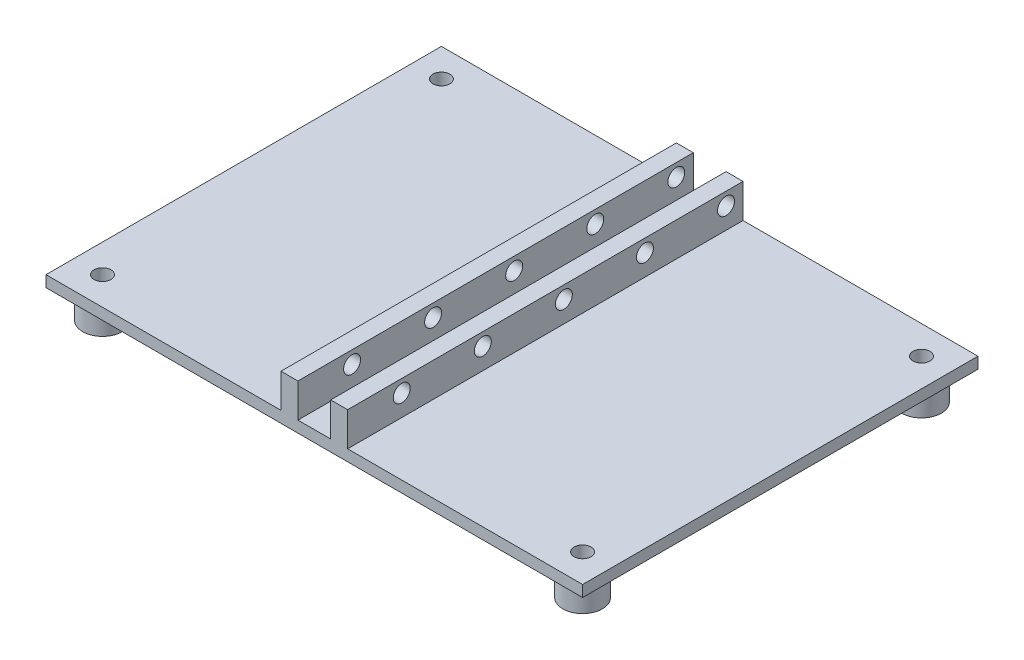
ISO-10303-21;
HEADER;
FILE_DESCRIPTION(('STEP AP214'),'2;1');
FILE_NAME('part.step','',(''),(''),'','','');
FILE_SCHEMA(('AUTOMOTIVE_DESIGN { 1 0 10303 214 1 1 1 1 }'));
ENDSEC;
DATA;
#1=APPLICATION_CONTEXT('core data for automotive mechanical design processes');
#2=APPLICATION_PROTOCOL_DEFINITION('international standard','automotive_design',2000,#1);
#3=PRODUCT_CONTEXT('',#1,'mechanical');
#4=PRODUCT('Part','Part','',(#3));
#5=PRODUCT_RELATED_PRODUCT_CATEGORY('part','',(#4));
#6=PRODUCT_DEFINITION_FORMATION('','',#4);
#7=PRODUCT_DEFINITION_CONTEXT('part definition',#1,'design');
#8=PRODUCT_DEFINITION('design','',#6,#7);
#9=PRODUCT_DEFINITION_SHAPE('','',#8);
#10=(LENGTH_UNIT() NAMED_UNIT(*) SI_UNIT(.MILLI.,.METRE.));
#11=(NAMED_UNIT(*) PLANE_ANGLE_UNIT() SI_UNIT($,.RADIAN.));
#12=(NAMED_UNIT(*) SI_UNIT($,.STERADIAN.) SOLID_ANGLE_UNIT());
#13=UNCERTAINTY_MEASURE_WITH_UNIT(LENGTH_MEASURE(1.E-05),#10,'distance_accuracy_value','');
#14=(GEOMETRIC_REPRESENTATION_CONTEXT(3) GLOBAL_UNCERTAINTY_ASSIGNED_CONTEXT((#13)) GLOBAL_UNIT_ASSIGNED_CONTEXT((#10,
#11,#12)) REPRESENTATION_CONTEXT('',''));
#15=CARTESIAN_POINT('',(0.,0.,0.));
#16=DIRECTION('',(0.,0.,1.));
#17=DIRECTION('',(1.,0.,0.));
#18=AXIS2_PLACEMENT_3D('',#15,#16,#17);
#19=CARTESIAN_POINT('',(0.,0.,0.));
#20=DIRECTION('',(0.,1.,0.));
#21=DIRECTION('',(0.,0.,1.));
#22=AXIS2_PLACEMENT_3D('',#19,#20,#21);
#23=PLANE('',#22);
#24=CARTESIAN_POINT('',(42.5,0.,30.));
#25=DIRECTION('',(0.,1.,0.));
#26=DIRECTION('',(0.,0.,1.));
#27=AXIS2_PLACEMENT_3D('',#24,#25,#26);
#28=CIRCLE('',#27,3.5);
#29=CARTESIAN_POINT('',(42.5,0.,33.5));
#30=VERTEX_POINT('',#29);
#31=EDGE_CURVE('E47',#30,#30,#28,.F.);
#32=ORIENTED_EDGE('',*,*,#31,.F.);
#33=EDGE_LOOP('',(#32));
#34=FACE_BOUND('',#33,.T.);
#35=CARTESIAN_POINT('',(-42.5,0.,-30.));
#36=DIRECTION('',(0.,1.,0.));
#37=DIRECTION('',(0.,0.,1.));
#38=AXIS2_PLACEMENT_3D('',#35,#36,#37);
#39=CIRCLE('',#38,3.5);
#40=CARTESIAN_POINT('',(-42.5,0.,-26.5));
#41=VERTEX_POINT('',#40);
#42=EDGE_CURVE('E229',#41,#41,#39,.F.);
#43=ORIENTED_EDGE('',*,*,#42,.F.);
#44=EDGE_LOOP('',(#43));
#45=FACE_BOUND('',#44,.T.);
#46=DIRECTION('',(0.,0.,1.));
#47=VECTOR('',#46,1.);
#48=CARTESIAN_POINT('',(-47.5,0.,-35.));
#49=LINE('',#48,#47);
#50=CARTESIAN_POINT('',(-47.5,0.,-35.));
#51=VERTEX_POINT('',#50);
#52=CARTESIAN_POINT('',(-47.5,0.,35.));
#53=VERTEX_POINT('',#52);
#54=EDGE_CURVE('E197',#51,#53,#49,.T.);
#55=ORIENTED_EDGE('',*,*,#54,.F.);
#56=DIRECTION('',(-1.,0.,0.));
#57=VECTOR('',#56,1.);
#58=CARTESIAN_POINT('',(-47.5,0.,-35.));
#59=LINE('',#58,#57);
#60=CARTESIAN_POINT('',(47.5,0.,-35.));
#61=VERTEX_POINT('',#60);
#62=EDGE_CURVE('E201',#61,#51,#59,.T.);
#63=ORIENTED_EDGE('',*,*,#62,.F.);
#64=DIRECTION('',(0.,0.,-1.));
#65=VECTOR('',#64,1.);
#66=CARTESIAN_POINT('',(47.5,0.,-35.));
#67=LINE('',#66,#65);
#68=CARTESIAN_POINT('',(47.5,0.,35.));
#69=VERTEX_POINT('',#68);
#70=EDGE_CURVE('E215',#69,#61,#67,.T.);
#71=ORIENTED_EDGE('',*,*,#70,.F.);
#72=DIRECTION('',(1.,0.,0.));
#73=VECTOR('',#72,1.);
#74=CARTESIAN_POINT('',(-47.5,0.,35.));
#75=LINE('',#74,#73);
#76=EDGE_CURVE('E213',#53,#69,#75,.T.);
#77=ORIENTED_EDGE('',*,*,#76,.F.);
#78=EDGE_LOOP('',(#55,#63,#71,#77));
#79=FACE_BOUND('',#78,.T.);
#80=CARTESIAN_POINT('',(-42.5,0.,30.));
#81=DIRECTION('',(0.,1.,0.));
#82=DIRECTION('',(0.,0.,1.));
#83=AXIS2_PLACEMENT_3D('',#80,#81,#82);
#84=CIRCLE('',#83,3.5);
#85=CARTESIAN_POINT('',(-42.5,0.,33.5));
#86=VERTEX_POINT('',#85);
#87=EDGE_CURVE('E257',#86,#86,#84,.F.);
#88=ORIENTED_EDGE('',*,*,#87,.F.);
#89=EDGE_LOOP('',(#88));
#90=FACE_BOUND('',#89,.T.);
#91=CARTESIAN_POINT('',(42.5,0.,-30.));
#92=DIRECTION('',(0.,1.,0.));
#93=DIRECTION('',(0.,0.,1.));
#94=AXIS2_PLACEMENT_3D('',#91,#92,#93);
#95=CIRCLE('',#94,3.5);
#96=CARTESIAN_POINT('',(42.5,0.,-26.5));
#97=VERTEX_POINT('',#96);
#98=EDGE_CURVE('E11',#97,#97,#95,.F.);
#99=ORIENTED_EDGE('',*,*,#98,.F.);
#100=EDGE_LOOP('',(#99));
#101=FACE_BOUND('',#100,.T.);
#102=ADVANCED_FACE('F39',(#34,#45,#79,#90,#101),#23,.F.);
#103=CARTESIAN_POINT('',(0.,2.,0.));
#104=DIRECTION('',(0.,1.,0.));
#105=DIRECTION('',(0.,0.,1.));
#106=AXIS2_PLACEMENT_3D('',#103,#104,#105);
#107=PLANE('',#106);
#108=CARTESIAN_POINT('',(42.5,2.,-30.));
#109=DIRECTION('',(0.,1.,0.));
#110=DIRECTION('',(0.,0.,1.));
#111=AXIS2_PLACEMENT_3D('',#108,#109,#110);
#112=CIRCLE('',#111,1.5);
#113=CARTESIAN_POINT('',(42.5,2.,-28.5));
#114=VERTEX_POINT('',#113);
#115=EDGE_CURVE('E188',#114,#114,#112,.T.);
#116=ORIENTED_EDGE('',*,*,#115,.F.);
#117=EDGE_LOOP('',(#116));
#118=FACE_BOUND('',#117,.T.);
#119=CARTESIAN_POINT('',(42.5,2.,30.));
#120=DIRECTION('',(0.,1.,0.));
#121=DIRECTION('',(0.,0.,1.));
#122=AXIS2_PLACEMENT_3D('',#119,#120,#121);
#123=CIRCLE('',#122,1.5);
#124=CARTESIAN_POINT('',(42.5,2.,31.5));
#125=VERTEX_POINT('',#124);
#126=EDGE_CURVE('E185',#125,#125,#123,.T.);
#127=ORIENTED_EDGE('',*,*,#126,.F.);
#128=EDGE_LOOP('',(#127));
#129=FACE_BOUND('',#128,.T.);
#130=DIRECTION('',(-1.,0.,0.));
#131=VECTOR('',#130,1.);
#132=CARTESIAN_POINT('',(-47.5,2.,-35.));
#133=LINE('',#132,#131);
#134=CARTESIAN_POINT('',(47.5,2.,-35.));
#135=VERTEX_POINT('',#134);
#136=CARTESIAN_POINT('',(5.9,2.,-35.));
#137=VERTEX_POINT('',#136);
#138=EDGE_CURVE('E207',#135,#137,#133,.T.);
#139=ORIENTED_EDGE('',*,*,#138,.T.);
#140=DIRECTION('',(0.,0.,-1.));
#141=VECTOR('',#140,1.);
#142=CARTESIAN_POINT('',(5.9,2.,35.));
#143=LINE('',#142,#141);
#144=CARTESIAN_POINT('',(5.9,2.,35.));
#145=VERTEX_POINT('',#144);
#146=EDGE_CURVE('E54',#145,#137,#143,.T.);
#147=ORIENTED_EDGE('',*,*,#146,.F.);
#148=DIRECTION('',(1.,0.,0.));
#149=VECTOR('',#148,1.);
#150=CARTESIAN_POINT('',(-47.5,2.,35.));
#151=LINE('',#150,#149);
#152=CARTESIAN_POINT('',(47.5,2.,35.));
#153=VERTEX_POINT('',#152);
#154=EDGE_CURVE('E152',#145,#153,#151,.T.);
#155=ORIENTED_EDGE('',*,*,#154,.T.);
#156=DIRECTION('',(0.,0.,-1.));
#157=VECTOR('',#156,1.);
#158=CARTESIAN_POINT('',(47.5,2.,-35.));
#159=LINE('',#158,#157);
#160=EDGE_CURVE('E204',#153,#135,#159,.T.);
#161=ORIENTED_EDGE('',*,*,#160,.T.);
#162=EDGE_LOOP('',(#139,#147,#155,#161));
#163=FACE_BOUND('',#162,.T.);
#164=ADVANCED_FACE('F266',(#118,#129,#163),#107,.T.);
#165=CARTESIAN_POINT('',(-2.9,2.,35.));
#166=VERTEX_POINT('',#165);
#167=CARTESIAN_POINT('',(2.9,2.,35.));
#168=VERTEX_POINT('',#167);
#169=EDGE_CURVE('E62',#166,#168,#151,.T.);
#170=ORIENTED_EDGE('',*,*,#169,.T.);
#171=DIRECTION('',(0.,0.,1.));
#172=VECTOR('',#171,1.);
#173=CARTESIAN_POINT('',(2.9,2.,35.));
#174=LINE('',#173,#172);
#175=CARTESIAN_POINT('',(2.9,2.,-35.));
#176=VERTEX_POINT('',#175);
#177=EDGE_CURVE('E148',#176,#168,#174,.T.);
#178=ORIENTED_EDGE('',*,*,#177,.F.);
#179=CARTESIAN_POINT('',(-2.9,2.,-35.));
#180=VERTEX_POINT('',#179);
#181=EDGE_CURVE('E210',#176,#180,#133,.T.);
#182=ORIENTED_EDGE('',*,*,#181,.T.);
#183=DIRECTION('',(0.,0.,-1.));
#184=VECTOR('',#183,1.);
#185=CARTESIAN_POINT('',(-2.9,2.,35.));
#186=LINE('',#185,#184);
#187=EDGE_CURVE('E153',#166,#180,#186,.T.);
#188=ORIENTED_EDGE('',*,*,#187,.F.);
#189=EDGE_LOOP('',(#170,#178,#182,#188));
#190=FACE_BOUND('',#189,.T.);
#191=ADVANCED_FACE('F376',(#190),#107,.T.);
#192=DIRECTION('',(0.,0.,1.));
#193=VECTOR('',#192,1.);
#194=CARTESIAN_POINT('',(-5.9,2.,35.));
#195=LINE('',#194,#193);
#196=CARTESIAN_POINT('',(-5.9,2.,-35.));
#197=VERTEX_POINT('',#196);
#198=CARTESIAN_POINT('',(-5.9,2.,35.));
#199=VERTEX_POINT('',#198);
#200=EDGE_CURVE('E156',#197,#199,#195,.T.);
#201=ORIENTED_EDGE('',*,*,#200,.F.);
#202=CARTESIAN_POINT('',(-47.5,2.,-35.));
#203=VERTEX_POINT('',#202);
#204=EDGE_CURVE('E206',#197,#203,#133,.T.);
#205=ORIENTED_EDGE('',*,*,#204,.T.);
#206=DIRECTION('',(0.,0.,1.));
#207=VECTOR('',#206,1.);
#208=CARTESIAN_POINT('',(-47.5,2.,-35.));
#209=LINE('',#208,#207);
#210=CARTESIAN_POINT('',(-47.5,2.,35.));
#211=VERTEX_POINT('',#210);
#212=EDGE_CURVE('E198',#203,#211,#209,.T.);
#213=ORIENTED_EDGE('',*,*,#212,.T.);
#214=EDGE_CURVE('E202',#211,#199,#151,.T.);
#215=ORIENTED_EDGE('',*,*,#214,.T.);
#216=EDGE_LOOP('',(#201,#205,#213,#215));
#217=FACE_BOUND('',#216,.T.);
#218=CARTESIAN_POINT('',(-42.5,2.,30.));
#219=DIRECTION('',(0.,1.,0.));
#220=DIRECTION('',(0.,0.,1.));
#221=AXIS2_PLACEMENT_3D('',#218,#219,#220);
#222=CIRCLE('',#221,1.5);
#223=CARTESIAN_POINT('',(-42.5,2.,31.5));
#224=VERTEX_POINT('',#223);
#225=EDGE_CURVE('E191',#224,#224,#222,.T.);
#226=ORIENTED_EDGE('',*,*,#225,.F.);
#227=EDGE_LOOP('',(#226));
#228=FACE_BOUND('',#227,.T.);
#229=CARTESIAN_POINT('',(-42.5,2.,-30.));
#230=DIRECTION('',(0.,1.,0.));
#231=DIRECTION('',(0.,0.,1.));
#232=AXIS2_PLACEMENT_3D('',#229,#230,#231);
#233=CIRCLE('',#232,1.5);
#234=CARTESIAN_POINT('',(-42.5,2.,-28.5));
#235=VERTEX_POINT('',#234);
#236=EDGE_CURVE('E194',#235,#235,#233,.T.);
#237=ORIENTED_EDGE('',*,*,#236,.F.);
#238=EDGE_LOOP('',(#237));
#239=FACE_BOUND('',#238,.T.);
#240=ADVANCED_FACE('F378',(#217,#228,#239),#107,.T.);
#241=CARTESIAN_POINT('',(-47.5,2.,-35.));
#242=DIRECTION('',(1.,0.,0.));
#243=DIRECTION('',(0.,0.,-1.));
#244=AXIS2_PLACEMENT_3D('',#241,#242,#243);
#245=PLANE('',#244);
#246=ORIENTED_EDGE('',*,*,#54,.T.);
#247=DIRECTION('',(0.,-1.,0.));
#248=VECTOR('',#247,1.);
#249=CARTESIAN_POINT('',(-47.5,2.,35.));
#250=LINE('',#249,#248);
#251=EDGE_CURVE('E226',#211,#53,#250,.T.);
#252=ORIENTED_EDGE('',*,*,#251,.F.);
#253=ORIENTED_EDGE('',*,*,#212,.F.);
#254=DIRECTION('',(0.,-1.,0.));
#255=VECTOR('',#254,1.);
#256=CARTESIAN_POINT('',(-47.5,2.,-35.));
#257=LINE('',#256,#255);
#258=EDGE_CURVE('E209',#203,#51,#257,.T.);
#259=ORIENTED_EDGE('',*,*,#258,.T.);
#260=EDGE_LOOP('',(#246,#252,#253,#259));
#261=FACE_BOUND('',#260,.T.);
#262=ADVANCED_FACE('F41',(#261),#245,.F.);
#263=CARTESIAN_POINT('',(-47.5,2.,35.));
#264=DIRECTION('',(0.,0.,-1.));
#265=DIRECTION('',(-1.,0.,0.));
#266=AXIS2_PLACEMENT_3D('',#263,#264,#265);
#267=PLANE('',#266);
#268=ORIENTED_EDGE('',*,*,#76,.T.);
#269=DIRECTION('',(0.,-1.,0.));
#270=VECTOR('',#269,1.);
#271=CARTESIAN_POINT('',(47.5,2.,35.));
#272=LINE('',#271,#270);
#273=EDGE_CURVE('E223',#153,#69,#272,.T.);
#274=ORIENTED_EDGE('',*,*,#273,.F.);
#275=ORIENTED_EDGE('',*,*,#154,.F.);
#276=DIRECTION('',(0.,-1.,0.));
#277=VECTOR('',#276,1.);
#278=CARTESIAN_POINT('',(5.9,8.,35.));
#279=LINE('',#278,#277);
#280=CARTESIAN_POINT('',(5.9,8.,35.));
#281=VERTEX_POINT('',#280);
#282=EDGE_CURVE('E133',#281,#145,#279,.T.);
#283=ORIENTED_EDGE('',*,*,#282,.F.);
#284=DIRECTION('',(1.,0.,0.));
#285=VECTOR('',#284,1.);
#286=CARTESIAN_POINT('',(2.9,8.,35.));
#287=LINE('',#286,#285);
#288=CARTESIAN_POINT('',(2.9,8.,35.));
#289=VERTEX_POINT('',#288);
#290=EDGE_CURVE('E139',#289,#281,#287,.T.);
#291=ORIENTED_EDGE('',*,*,#290,.F.);
#292=DIRECTION('',(0.,-1.,0.));
#293=VECTOR('',#292,1.);
#294=CARTESIAN_POINT('',(2.9,8.,35.));
#295=LINE('',#294,#293);
#296=EDGE_CURVE('E414',#289,#168,#295,.T.);
#297=ORIENTED_EDGE('',*,*,#296,.T.);
#298=ORIENTED_EDGE('',*,*,#169,.F.);
#299=DIRECTION('',(0.,-1.,0.));
#300=VECTOR('',#299,1.);
#301=CARTESIAN_POINT('',(-2.9,8.,35.));
#302=LINE('',#301,#300);
#303=CARTESIAN_POINT('',(-2.9,8.,35.));
#304=VERTEX_POINT('',#303);
#305=EDGE_CURVE('E182',#304,#166,#302,.T.);
#306=ORIENTED_EDGE('',*,*,#305,.F.);
#307=DIRECTION('',(1.,0.,0.));
#308=VECTOR('',#307,1.);
#309=CARTESIAN_POINT('',(-5.9,8.,35.));
#310=LINE('',#309,#308);
#311=CARTESIAN_POINT('',(-5.9,8.,35.));
#312=VERTEX_POINT('',#311);
#313=EDGE_CURVE('E162',#312,#304,#310,.T.);
#314=ORIENTED_EDGE('',*,*,#313,.F.);
#315=DIRECTION('',(0.,-1.,0.));
#316=VECTOR('',#315,1.);
#317=CARTESIAN_POINT('',(-5.9,8.,35.));
#318=LINE('',#317,#316);
#319=EDGE_CURVE('E170',#312,#199,#318,.T.);
#320=ORIENTED_EDGE('',*,*,#319,.T.);
#321=ORIENTED_EDGE('',*,*,#214,.F.);
#322=ORIENTED_EDGE('',*,*,#251,.T.);
#323=EDGE_LOOP('',(#268,#274,#275,#283,#291,#297,#298,#306,#314,#320,#321,#322));
#324=FACE_BOUND('',#323,.T.);
#325=ADVANCED_FACE('F150',(#324),#267,.F.);
#326=CARTESIAN_POINT('',(47.5,2.,-35.));
#327=DIRECTION('',(-1.,0.,0.));
#328=DIRECTION('',(0.,0.,1.));
#329=AXIS2_PLACEMENT_3D('',#326,#327,#328);
#330=PLANE('',#329);
#331=ORIENTED_EDGE('',*,*,#70,.T.);
#332=DIRECTION('',(0.,-1.,0.));
#333=VECTOR('',#332,1.);
#334=CARTESIAN_POINT('',(47.5,2.,-35.));
#335=LINE('',#334,#333);
#336=EDGE_CURVE('E220',#135,#61,#335,.T.);
#337=ORIENTED_EDGE('',*,*,#336,.F.);
#338=ORIENTED_EDGE('',*,*,#160,.F.);
#339=ORIENTED_EDGE('',*,*,#273,.T.);
#340=EDGE_LOOP('',(#331,#337,#338,#339));
#341=FACE_BOUND('',#340,.T.);
#342=ADVANCED_FACE('F382',(#341),#330,.F.);
#343=CARTESIAN_POINT('',(-47.5,2.,-35.));
#344=DIRECTION('',(0.,0.,1.));
#345=DIRECTION('',(1.,0.,0.));
#346=AXIS2_PLACEMENT_3D('',#343,#344,#345);
#347=PLANE('',#346);
#348=ORIENTED_EDGE('',*,*,#62,.T.);
#349=ORIENTED_EDGE('',*,*,#258,.F.);
#350=ORIENTED_EDGE('',*,*,#204,.F.);
#351=DIRECTION('',(0.,-1.,0.));
#352=VECTOR('',#351,1.);
#353=CARTESIAN_POINT('',(-5.9,8.,-35.));
#354=LINE('',#353,#352);
#355=CARTESIAN_POINT('',(-5.9,8.,-35.));
#356=VERTEX_POINT('',#355);
#357=EDGE_CURVE('E176',#356,#197,#354,.T.);
#358=ORIENTED_EDGE('',*,*,#357,.F.);
#359=DIRECTION('',(-1.,0.,0.));
#360=VECTOR('',#359,1.);
#361=CARTESIAN_POINT('',(-2.9,8.,-35.));
#362=LINE('',#361,#360);
#363=CARTESIAN_POINT('',(-2.9,8.,-35.));
#364=VERTEX_POINT('',#363);
#365=EDGE_CURVE('E167',#364,#356,#362,.T.);
#366=ORIENTED_EDGE('',*,*,#365,.F.);
#367=DIRECTION('',(0.,-1.,0.));
#368=VECTOR('',#367,1.);
#369=CARTESIAN_POINT('',(-2.9,8.,-35.));
#370=LINE('',#369,#368);
#371=EDGE_CURVE('E179',#364,#180,#370,.T.);
#372=ORIENTED_EDGE('',*,*,#371,.T.);
#373=ORIENTED_EDGE('',*,*,#181,.F.);
#374=DIRECTION('',(0.,-1.,0.));
#375=VECTOR('',#374,1.);
#376=CARTESIAN_POINT('',(2.9,8.,-35.));
#377=LINE('',#376,#375);
#378=CARTESIAN_POINT('',(2.9,8.,-35.));
#379=VERTEX_POINT('',#378);
#380=EDGE_CURVE('E158',#379,#176,#377,.T.);
#381=ORIENTED_EDGE('',*,*,#380,.F.);
#382=DIRECTION('',(-1.,0.,0.));
#383=VECTOR('',#382,1.);
#384=CARTESIAN_POINT('',(5.9,8.,-35.));
#385=LINE('',#384,#383);
#386=CARTESIAN_POINT('',(5.9,8.,-35.));
#387=VERTEX_POINT('',#386);
#388=EDGE_CURVE('E138',#387,#379,#385,.T.);
#389=ORIENTED_EDGE('',*,*,#388,.F.);
#390=DIRECTION('',(0.,-1.,0.));
#391=VECTOR('',#390,1.);
#392=CARTESIAN_POINT('',(5.9,8.,-35.));
#393=LINE('',#392,#391);
#394=EDGE_CURVE('E135',#387,#137,#393,.T.);
#395=ORIENTED_EDGE('',*,*,#394,.T.);
#396=ORIENTED_EDGE('',*,*,#138,.F.);
#397=ORIENTED_EDGE('',*,*,#336,.T.);
#398=EDGE_LOOP('',(#348,#349,#350,#358,#366,#372,#373,#381,#389,#395,#396,#397));
#399=FACE_BOUND('',#398,.T.);
#400=ADVANCED_FACE('F373',(#399),#347,.F.);
#401=CARTESIAN_POINT('',(-42.5,2.,-30.));
#402=DIRECTION('',(0.,-1.,0.));
#403=DIRECTION('',(0.,0.,-1.));
#404=AXIS2_PLACEMENT_3D('',#401,#402,#403);
#405=CYLINDRICAL_SURFACE('',#404,1.5);
#406=ORIENTED_EDGE('',*,*,#236,.T.);
#407=EDGE_LOOP('',(#406));
#408=FACE_BOUND('',#407,.T.);
#409=CARTESIAN_POINT('',(-42.5,-5.,-30.));
#410=DIRECTION('',(0.,-1.,0.));
#411=DIRECTION('',(0.,0.,-1.));
#412=AXIS2_PLACEMENT_3D('',#409,#410,#411);
#413=CIRCLE('',#412,1.5);
#414=CARTESIAN_POINT('',(-42.5,-5.,-31.5));
#415=VERTEX_POINT('',#414);
#416=EDGE_CURVE('E460',#415,#415,#413,.T.);
#417=ORIENTED_EDGE('',*,*,#416,.T.);
#418=EDGE_LOOP('',(#417));
#419=FACE_BOUND('',#418,.T.);
#420=ADVANCED_FACE('F369',(#408,#419),#405,.F.);
#421=CARTESIAN_POINT('',(-42.5,2.,30.));
#422=DIRECTION('',(0.,-1.,0.));
#423=DIRECTION('',(0.,0.,-1.));
#424=AXIS2_PLACEMENT_3D('',#421,#422,#423);
#425=CYLINDRICAL_SURFACE('',#424,1.5);
#426=ORIENTED_EDGE('',*,*,#225,.T.);
#427=EDGE_LOOP('',(#426));
#428=FACE_BOUND('',#427,.T.);
#429=CARTESIAN_POINT('',(-42.5,-5.,30.));
#430=DIRECTION('',(0.,-1.,0.));
#431=DIRECTION('',(0.,0.,-1.));
#432=AXIS2_PLACEMENT_3D('',#429,#430,#431);
#433=CIRCLE('',#432,1.5);
#434=CARTESIAN_POINT('',(-42.5,-5.,28.5));
#435=VERTEX_POINT('',#434);
#436=EDGE_CURVE('E466',#435,#435,#433,.T.);
#437=ORIENTED_EDGE('',*,*,#436,.T.);
#438=EDGE_LOOP('',(#437));
#439=FACE_BOUND('',#438,.T.);
#440=ADVANCED_FACE('F365',(#428,#439),#425,.F.);
#441=CARTESIAN_POINT('',(42.5,2.,-30.));
#442=DIRECTION('',(0.,-1.,0.));
#443=DIRECTION('',(0.,0.,-1.));
#444=AXIS2_PLACEMENT_3D('',#441,#442,#443);
#445=CYLINDRICAL_SURFACE('',#444,1.5);
#446=ORIENTED_EDGE('',*,*,#115,.T.);
#447=EDGE_LOOP('',(#446));
#448=FACE_BOUND('',#447,.T.);
#449=CARTESIAN_POINT('',(42.5,-5.,-30.));
#450=DIRECTION('',(0.,-1.,0.));
#451=DIRECTION('',(0.,0.,-1.));
#452=AXIS2_PLACEMENT_3D('',#449,#450,#451);
#453=CIRCLE('',#452,1.5);
#454=CARTESIAN_POINT('',(42.5,-5.,-31.5));
#455=VERTEX_POINT('',#454);
#456=EDGE_CURVE('E478',#455,#455,#453,.T.);
#457=ORIENTED_EDGE('',*,*,#456,.T.);
#458=EDGE_LOOP('',(#457));
#459=FACE_BOUND('',#458,.T.);
#460=ADVANCED_FACE('F361',(#448,#459),#445,.F.);
#461=CARTESIAN_POINT('',(42.5,2.,30.));
#462=DIRECTION('',(0.,-1.,0.));
#463=DIRECTION('',(0.,0.,-1.));
#464=AXIS2_PLACEMENT_3D('',#461,#462,#463);
#465=CYLINDRICAL_SURFACE('',#464,1.5);
#466=ORIENTED_EDGE('',*,*,#126,.T.);
#467=EDGE_LOOP('',(#466));
#468=FACE_BOUND('',#467,.T.);
#469=CARTESIAN_POINT('',(42.5,-5.,30.));
#470=DIRECTION('',(0.,-1.,0.));
#471=DIRECTION('',(0.,0.,-1.));
#472=AXIS2_PLACEMENT_3D('',#469,#470,#471);
#473=CIRCLE('',#472,1.5);
#474=CARTESIAN_POINT('',(42.5,-5.,28.5));
#475=VERTEX_POINT('',#474);
#476=EDGE_CURVE('E472',#475,#475,#473,.T.);
#477=ORIENTED_EDGE('',*,*,#476,.T.);
#478=EDGE_LOOP('',(#477));
#479=FACE_BOUND('',#478,.T.);
#480=ADVANCED_FACE('F357',(#468,#479),#465,.F.);
#481=CARTESIAN_POINT('',(-2.9,8.,35.));
#482=DIRECTION('',(-1.,0.,0.));
#483=DIRECTION('',(0.,0.,1.));
#484=AXIS2_PLACEMENT_3D('',#481,#482,#483);
#485=PLANE('',#484);
#486=CARTESIAN_POINT('',(-2.9,5.75,-31.9858509541961));
#487=DIRECTION('',(-1.,0.,0.));
#488=DIRECTION('',(0.,0.,1.));
#489=AXIS2_PLACEMENT_3D('',#486,#487,#488);
#490=CIRCLE('',#489,1.5);
#491=CARTESIAN_POINT('',(-2.9,5.75,-30.4858509541961));
#492=VERTEX_POINT('',#491);
#493=EDGE_CURVE('E415',#492,#492,#490,.T.);
#494=ORIENTED_EDGE('',*,*,#493,.T.);
#495=EDGE_LOOP('',(#494));
#496=FACE_BOUND('',#495,.T.);
#497=CARTESIAN_POINT('',(-2.9,5.75,-17.6358509541961));
#498=DIRECTION('',(-1.,0.,0.));
#499=DIRECTION('',(0.,0.,1.));
#500=AXIS2_PLACEMENT_3D('',#497,#498,#499);
#501=CIRCLE('',#500,1.5);
#502=CARTESIAN_POINT('',(-2.9,5.75,-16.1358509541961));
#503=VERTEX_POINT('',#502);
#504=EDGE_CURVE('E254',#503,#503,#501,.T.);
#505=ORIENTED_EDGE('',*,*,#504,.T.);
#506=EDGE_LOOP('',(#505));
#507=FACE_BOUND('',#506,.T.);
#508=CARTESIAN_POINT('',(-2.9,5.75,-3.28585095419614));
#509=DIRECTION('',(-1.,0.,0.));
#510=DIRECTION('',(0.,0.,1.));
#511=AXIS2_PLACEMENT_3D('',#508,#509,#510);
#512=CIRCLE('',#511,1.5);
#513=CARTESIAN_POINT('',(-2.9,5.75,-1.78585095419614));
#514=VERTEX_POINT('',#513);
#515=EDGE_CURVE('E249',#514,#514,#512,.T.);
#516=ORIENTED_EDGE('',*,*,#515,.T.);
#517=EDGE_LOOP('',(#516));
#518=FACE_BOUND('',#517,.T.);
#519=CARTESIAN_POINT('',(-2.9,5.75,11.0641490458039));
#520=DIRECTION('',(-1.,0.,0.));
#521=DIRECTION('',(0.,0.,1.));
#522=AXIS2_PLACEMENT_3D('',#519,#520,#521);
#523=CIRCLE('',#522,1.5);
#524=CARTESIAN_POINT('',(-2.9,5.75,12.5641490458039));
#525=VERTEX_POINT('',#524);
#526=EDGE_CURVE('E244',#525,#525,#523,.T.);
#527=ORIENTED_EDGE('',*,*,#526,.T.);
#528=EDGE_LOOP('',(#527));
#529=FACE_BOUND('',#528,.T.);
#530=CARTESIAN_POINT('',(-2.9,5.75,25.4141490458039));
#531=DIRECTION('',(-1.,0.,0.));
#532=DIRECTION('',(0.,0.,1.));
#533=AXIS2_PLACEMENT_3D('',#530,#531,#532);
#534=CIRCLE('',#533,1.5);
#535=CARTESIAN_POINT('',(-2.9,5.75,26.9141490458039));
#536=VERTEX_POINT('',#535);
#537=EDGE_CURVE('E239',#536,#536,#534,.T.);
#538=ORIENTED_EDGE('',*,*,#537,.T.);
#539=EDGE_LOOP('',(#538));
#540=FACE_BOUND('',#539,.T.);
#541=ORIENTED_EDGE('',*,*,#187,.T.);
#542=ORIENTED_EDGE('',*,*,#371,.F.);
#543=DIRECTION('',(0.,0.,-1.));
#544=VECTOR('',#543,1.);
#545=CARTESIAN_POINT('',(-2.9,8.,35.));
#546=LINE('',#545,#544);
#547=EDGE_CURVE('E165',#304,#364,#546,.T.);
#548=ORIENTED_EDGE('',*,*,#547,.F.);
#549=ORIENTED_EDGE('',*,*,#305,.T.);
#550=EDGE_LOOP('',(#541,#542,#548,#549));
#551=FACE_BOUND('',#550,.T.);
#552=ADVANCED_FACE('F353',(#496,#507,#518,#529,#540,#551),#485,.F.);
#553=CARTESIAN_POINT('',(-5.9,8.,35.));
#554=DIRECTION('',(1.,0.,0.));
#555=DIRECTION('',(0.,0.,-1.));
#556=AXIS2_PLACEMENT_3D('',#553,#554,#555);
#557=PLANE('',#556);
#558=CARTESIAN_POINT('',(-5.9,5.75,-31.9858509541961));
#559=DIRECTION('',(-1.,0.,0.));
#560=DIRECTION('',(0.,0.,1.));
#561=AXIS2_PLACEMENT_3D('',#558,#559,#560);
#562=CIRCLE('',#561,1.5);
#563=CARTESIAN_POINT('',(-5.9,5.75,-30.4858509541961));
#564=VERTEX_POINT('',#563);
#565=EDGE_CURVE('E234',#564,#564,#562,.T.);
#566=ORIENTED_EDGE('',*,*,#565,.F.);
#567=EDGE_LOOP('',(#566));
#568=FACE_BOUND('',#567,.T.);
#569=CARTESIAN_POINT('',(-5.9,5.75,-17.6358509541961));
#570=DIRECTION('',(-1.,0.,0.));
#571=DIRECTION('',(0.,0.,1.));
#572=AXIS2_PLACEMENT_3D('',#569,#570,#571);
#573=CIRCLE('',#572,1.5);
#574=CARTESIAN_POINT('',(-5.9,5.75,-16.1358509541961));
#575=VERTEX_POINT('',#574);
#576=EDGE_CURVE('E453',#575,#575,#573,.T.);
#577=ORIENTED_EDGE('',*,*,#576,.F.);
#578=EDGE_LOOP('',(#577));
#579=FACE_BOUND('',#578,.T.);
#580=CARTESIAN_POINT('',(-5.9,5.75,-3.28585095419614));
#581=DIRECTION('',(-1.,0.,0.));
#582=DIRECTION('',(0.,0.,1.));
#583=AXIS2_PLACEMENT_3D('',#580,#581,#582);
#584=CIRCLE('',#583,1.5);
#585=CARTESIAN_POINT('',(-5.9,5.75,-1.78585095419614));
#586=VERTEX_POINT('',#585);
#587=EDGE_CURVE('E450',#586,#586,#584,.T.);
#588=ORIENTED_EDGE('',*,*,#587,.F.);
#589=EDGE_LOOP('',(#588));
#590=FACE_BOUND('',#589,.T.);
#591=CARTESIAN_POINT('',(-5.9,5.75,11.0641490458039));
#592=DIRECTION('',(-1.,0.,0.));
#593=DIRECTION('',(0.,0.,1.));
#594=AXIS2_PLACEMENT_3D('',#591,#592,#593);
#595=CIRCLE('',#594,1.5);
#596=CARTESIAN_POINT('',(-5.9,5.75,12.5641490458039));
#597=VERTEX_POINT('',#596);
#598=EDGE_CURVE('E446',#597,#597,#595,.T.);
#599=ORIENTED_EDGE('',*,*,#598,.F.);
#600=EDGE_LOOP('',(#599));
#601=FACE_BOUND('',#600,.T.);
#602=CARTESIAN_POINT('',(-5.9,5.75,25.4141490458039));
#603=DIRECTION('',(-1.,0.,0.));
#604=DIRECTION('',(0.,0.,1.));
#605=AXIS2_PLACEMENT_3D('',#602,#603,#604);
#606=CIRCLE('',#605,1.5);
#607=CARTESIAN_POINT('',(-5.9,5.75,26.9141490458039));
#608=VERTEX_POINT('',#607);
#609=EDGE_CURVE('E443',#608,#608,#606,.T.);
#610=ORIENTED_EDGE('',*,*,#609,.F.);
#611=EDGE_LOOP('',(#610));
#612=FACE_BOUND('',#611,.T.);
#613=ORIENTED_EDGE('',*,*,#200,.T.);
#614=ORIENTED_EDGE('',*,*,#319,.F.);
#615=DIRECTION('',(0.,0.,1.));
#616=VECTOR('',#615,1.);
#617=CARTESIAN_POINT('',(-5.9,8.,35.));
#618=LINE('',#617,#616);
#619=EDGE_CURVE('E169',#356,#312,#618,.T.);
#620=ORIENTED_EDGE('',*,*,#619,.F.);
#621=ORIENTED_EDGE('',*,*,#357,.T.);
#622=EDGE_LOOP('',(#613,#614,#620,#621));
#623=FACE_BOUND('',#622,.T.);
#624=ADVANCED_FACE('F349',(#568,#579,#590,#601,#612,#623),#557,.F.);
#625=CARTESIAN_POINT('',(0.,8.,0.));
#626=DIRECTION('',(0.,1.,0.));
#627=DIRECTION('',(0.,0.,1.));
#628=AXIS2_PLACEMENT_3D('',#625,#626,#627);
#629=PLANE('',#628);
#630=ORIENTED_EDGE('',*,*,#313,.T.);
#631=ORIENTED_EDGE('',*,*,#547,.T.);
#632=ORIENTED_EDGE('',*,*,#365,.T.);
#633=ORIENTED_EDGE('',*,*,#619,.T.);
#634=EDGE_LOOP('',(#630,#631,#632,#633));
#635=FACE_BOUND('',#634,.T.);
#636=ADVANCED_FACE('F345',(#635),#629,.T.);
#637=CARTESIAN_POINT('',(5.9,8.,35.));
#638=DIRECTION('',(-1.,0.,0.));
#639=DIRECTION('',(0.,0.,1.));
#640=AXIS2_PLACEMENT_3D('',#637,#638,#639);
#641=PLANE('',#640);
#642=CARTESIAN_POINT('',(5.9,5.75,-31.9858509541961));
#643=DIRECTION('',(-1.,0.,0.));
#644=DIRECTION('',(0.,0.,1.));
#645=AXIS2_PLACEMENT_3D('',#642,#643,#644);
#646=CIRCLE('',#645,1.5);
#647=CARTESIAN_POINT('',(5.9,5.75,-30.4858509541961));
#648=VERTEX_POINT('',#647);
#649=EDGE_CURVE('E253',#648,#648,#646,.T.);
#650=ORIENTED_EDGE('',*,*,#649,.T.);
#651=EDGE_LOOP('',(#650));
#652=FACE_BOUND('',#651,.T.);
#653=CARTESIAN_POINT('',(5.9,5.75,-17.6358509541961));
#654=DIRECTION('',(-1.,0.,0.));
#655=DIRECTION('',(0.,0.,1.));
#656=AXIS2_PLACEMENT_3D('',#653,#654,#655);
#657=CIRCLE('',#656,1.5);
#658=CARTESIAN_POINT('',(5.9,5.75,-16.1358509541961));
#659=VERTEX_POINT('',#658);
#660=EDGE_CURVE('E248',#659,#659,#657,.T.);
#661=ORIENTED_EDGE('',*,*,#660,.T.);
#662=EDGE_LOOP('',(#661));
#663=FACE_BOUND('',#662,.T.);
#664=CARTESIAN_POINT('',(5.9,5.75,-3.28585095419614));
#665=DIRECTION('',(-1.,0.,0.));
#666=DIRECTION('',(0.,0.,1.));
#667=AXIS2_PLACEMENT_3D('',#664,#665,#666);
#668=CIRCLE('',#667,1.5);
#669=CARTESIAN_POINT('',(5.9,5.75,-1.78585095419614));
#670=VERTEX_POINT('',#669);
#671=EDGE_CURVE('E243',#670,#670,#668,.T.);
#672=ORIENTED_EDGE('',*,*,#671,.T.);
#673=EDGE_LOOP('',(#672));
#674=FACE_BOUND('',#673,.T.);
#675=CARTESIAN_POINT('',(5.9,5.75,11.0641490458039));
#676=DIRECTION('',(-1.,0.,0.));
#677=DIRECTION('',(0.,0.,1.));
#678=AXIS2_PLACEMENT_3D('',#675,#676,#677);
#679=CIRCLE('',#678,1.5);
#680=CARTESIAN_POINT('',(5.9,5.75,12.5641490458039));
#681=VERTEX_POINT('',#680);
#682=EDGE_CURVE('E238',#681,#681,#679,.T.);
#683=ORIENTED_EDGE('',*,*,#682,.T.);
#684=EDGE_LOOP('',(#683));
#685=FACE_BOUND('',#684,.T.);
#686=CARTESIAN_POINT('',(5.9,5.75,25.4141490458039));
#687=DIRECTION('',(-1.,0.,0.));
#688=DIRECTION('',(0.,0.,1.));
#689=AXIS2_PLACEMENT_3D('',#686,#687,#688);
#690=CIRCLE('',#689,1.5);
#691=CARTESIAN_POINT('',(5.9,5.75,26.9141490458039));
#692=VERTEX_POINT('',#691);
#693=EDGE_CURVE('E233',#692,#692,#690,.T.);
#694=ORIENTED_EDGE('',*,*,#693,.T.);
#695=EDGE_LOOP('',(#694));
#696=FACE_BOUND('',#695,.T.);
#697=ORIENTED_EDGE('',*,*,#146,.T.);
#698=ORIENTED_EDGE('',*,*,#394,.F.);
#699=DIRECTION('',(0.,0.,-1.));
#700=VECTOR('',#699,1.);
#701=CARTESIAN_POINT('',(5.9,8.,35.));
#702=LINE('',#701,#700);
#703=EDGE_CURVE('E129',#281,#387,#702,.T.);
#704=ORIENTED_EDGE('',*,*,#703,.F.);
#705=ORIENTED_EDGE('',*,*,#282,.T.);
#706=EDGE_LOOP('',(#697,#698,#704,#705));
#707=FACE_BOUND('',#706,.T.);
#708=ADVANCED_FACE('F131',(#652,#663,#674,#685,#696,#707),#641,.F.);
#709=CARTESIAN_POINT('',(2.9,8.,35.));
#710=DIRECTION('',(1.,0.,0.));
#711=DIRECTION('',(0.,0.,-1.));
#712=AXIS2_PLACEMENT_3D('',#709,#710,#711);
#713=PLANE('',#712);
#714=CARTESIAN_POINT('',(2.9,5.75,-31.9858509541961));
#715=DIRECTION('',(1.,0.,0.));
#716=DIRECTION('',(0.,0.,-1.));
#717=AXIS2_PLACEMENT_3D('',#714,#715,#716);
#718=CIRCLE('',#717,1.5);
#719=CARTESIAN_POINT('',(2.9,5.75,-33.4858509541961));
#720=VERTEX_POINT('',#719);
#721=EDGE_CURVE('E250',#720,#720,#718,.T.);
#722=ORIENTED_EDGE('',*,*,#721,.T.);
#723=EDGE_LOOP('',(#722));
#724=FACE_BOUND('',#723,.T.);
#725=CARTESIAN_POINT('',(2.9,5.75,-17.6358509541961));
#726=DIRECTION('',(1.,0.,0.));
#727=DIRECTION('',(0.,0.,-1.));
#728=AXIS2_PLACEMENT_3D('',#725,#726,#727);
#729=CIRCLE('',#728,1.5);
#730=CARTESIAN_POINT('',(2.9,5.75,-19.1358509541961));
#731=VERTEX_POINT('',#730);
#732=EDGE_CURVE('E245',#731,#731,#729,.T.);
#733=ORIENTED_EDGE('',*,*,#732,.T.);
#734=EDGE_LOOP('',(#733));
#735=FACE_BOUND('',#734,.T.);
#736=CARTESIAN_POINT('',(2.9,5.75,-3.28585095419614));
#737=DIRECTION('',(1.,0.,0.));
#738=DIRECTION('',(0.,0.,-1.));
#739=AXIS2_PLACEMENT_3D('',#736,#737,#738);
#740=CIRCLE('',#739,1.5);
#741=CARTESIAN_POINT('',(2.9,5.75,-4.78585095419614));
#742=VERTEX_POINT('',#741);
#743=EDGE_CURVE('E240',#742,#742,#740,.T.);
#744=ORIENTED_EDGE('',*,*,#743,.T.);
#745=EDGE_LOOP('',(#744));
#746=FACE_BOUND('',#745,.T.);
#747=CARTESIAN_POINT('',(2.9,5.75,11.0641490458039));
#748=DIRECTION('',(1.,0.,0.));
#749=DIRECTION('',(0.,0.,-1.));
#750=AXIS2_PLACEMENT_3D('',#747,#748,#749);
#751=CIRCLE('',#750,1.5);
#752=CARTESIAN_POINT('',(2.9,5.75,9.56414904580386));
#753=VERTEX_POINT('',#752);
#754=EDGE_CURVE('E235',#753,#753,#751,.T.);
#755=ORIENTED_EDGE('',*,*,#754,.T.);
#756=EDGE_LOOP('',(#755));
#757=FACE_BOUND('',#756,.T.);
#758=CARTESIAN_POINT('',(2.9,5.75,25.4141490458039));
#759=DIRECTION('',(1.,0.,0.));
#760=DIRECTION('',(0.,0.,-1.));
#761=AXIS2_PLACEMENT_3D('',#758,#759,#760);
#762=CIRCLE('',#761,1.5);
#763=CARTESIAN_POINT('',(2.9,5.75,23.9141490458039));
#764=VERTEX_POINT('',#763);
#765=EDGE_CURVE('E230',#764,#764,#762,.T.);
#766=ORIENTED_EDGE('',*,*,#765,.T.);
#767=EDGE_LOOP('',(#766));
#768=FACE_BOUND('',#767,.T.);
#769=ORIENTED_EDGE('',*,*,#177,.T.);
#770=ORIENTED_EDGE('',*,*,#296,.F.);
#771=DIRECTION('',(0.,0.,1.));
#772=VECTOR('',#771,1.);
#773=CARTESIAN_POINT('',(2.9,8.,35.));
#774=LINE('',#773,#772);
#775=EDGE_CURVE('E144',#379,#289,#774,.T.);
#776=ORIENTED_EDGE('',*,*,#775,.F.);
#777=ORIENTED_EDGE('',*,*,#380,.T.);
#778=EDGE_LOOP('',(#769,#770,#776,#777));
#779=FACE_BOUND('',#778,.T.);
#780=ADVANCED_FACE('F339',(#724,#735,#746,#757,#768,#779),#713,.F.);
#781=CARTESIAN_POINT('',(0.,8.,0.));
#782=DIRECTION('',(0.,1.,0.));
#783=DIRECTION('',(0.,0.,1.));
#784=AXIS2_PLACEMENT_3D('',#781,#782,#783);
#785=PLANE('',#784);
#786=ORIENTED_EDGE('',*,*,#290,.T.);
#787=ORIENTED_EDGE('',*,*,#703,.T.);
#788=ORIENTED_EDGE('',*,*,#388,.T.);
#789=ORIENTED_EDGE('',*,*,#775,.T.);
#790=EDGE_LOOP('',(#786,#787,#788,#789));
#791=FACE_BOUND('',#790,.T.);
#792=ADVANCED_FACE('F142',(#791),#785,.T.);
#793=CARTESIAN_POINT('',(47.5,5.75,25.4141490458039));
#794=DIRECTION('',(-1.,0.,0.));
#795=DIRECTION('',(0.,0.,1.));
#796=AXIS2_PLACEMENT_3D('',#793,#794,#795);
#797=CYLINDRICAL_SURFACE('',#796,1.5);
#798=ORIENTED_EDGE('',*,*,#765,.F.);
#799=EDGE_LOOP('',(#798));
#800=FACE_BOUND('',#799,.T.);
#801=ORIENTED_EDGE('',*,*,#693,.F.);
#802=EDGE_LOOP('',(#801));
#803=FACE_BOUND('',#802,.T.);
#804=ADVANCED_FACE('F336',(#800,#803),#797,.F.);
#805=CARTESIAN_POINT('',(47.5,5.75,11.0641490458039));
#806=DIRECTION('',(-1.,0.,0.));
#807=DIRECTION('',(0.,0.,1.));
#808=AXIS2_PLACEMENT_3D('',#805,#806,#807);
#809=CYLINDRICAL_SURFACE('',#808,1.5);
#810=ORIENTED_EDGE('',*,*,#754,.F.);
#811=EDGE_LOOP('',(#810));
#812=FACE_BOUND('',#811,.T.);
#813=ORIENTED_EDGE('',*,*,#682,.F.);
#814=EDGE_LOOP('',(#813));
#815=FACE_BOUND('',#814,.T.);
#816=ADVANCED_FACE('F332',(#812,#815),#809,.F.);
#817=CARTESIAN_POINT('',(47.5,5.75,-3.28585095419614));
#818=DIRECTION('',(-1.,0.,0.));
#819=DIRECTION('',(0.,0.,1.));
#820=AXIS2_PLACEMENT_3D('',#817,#818,#819);
#821=CYLINDRICAL_SURFACE('',#820,1.5);
#822=ORIENTED_EDGE('',*,*,#743,.F.);
#823=EDGE_LOOP('',(#822));
#824=FACE_BOUND('',#823,.T.);
#825=ORIENTED_EDGE('',*,*,#671,.F.);
#826=EDGE_LOOP('',(#825));
#827=FACE_BOUND('',#826,.T.);
#828=ADVANCED_FACE('F327',(#824,#827),#821,.F.);
#829=CARTESIAN_POINT('',(47.5,5.75,-17.6358509541961));
#830=DIRECTION('',(-1.,0.,0.));
#831=DIRECTION('',(0.,0.,1.));
#832=AXIS2_PLACEMENT_3D('',#829,#830,#831);
#833=CYLINDRICAL_SURFACE('',#832,1.5);
#834=ORIENTED_EDGE('',*,*,#732,.F.);
#835=EDGE_LOOP('',(#834));
#836=FACE_BOUND('',#835,.T.);
#837=ORIENTED_EDGE('',*,*,#660,.F.);
#838=EDGE_LOOP('',(#837));
#839=FACE_BOUND('',#838,.T.);
#840=ADVANCED_FACE('F322',(#836,#839),#833,.F.);
#841=CARTESIAN_POINT('',(47.5,5.75,-31.9858509541961));
#842=DIRECTION('',(-1.,0.,0.));
#843=DIRECTION('',(0.,0.,1.));
#844=AXIS2_PLACEMENT_3D('',#841,#842,#843);
#845=CYLINDRICAL_SURFACE('',#844,1.5);
#846=ORIENTED_EDGE('',*,*,#721,.F.);
#847=EDGE_LOOP('',(#846));
#848=FACE_BOUND('',#847,.T.);
#849=ORIENTED_EDGE('',*,*,#649,.F.);
#850=EDGE_LOOP('',(#849));
#851=FACE_BOUND('',#850,.T.);
#852=ADVANCED_FACE('F317',(#848,#851),#845,.F.);
#853=ORIENTED_EDGE('',*,*,#609,.T.);
#854=EDGE_LOOP('',(#853));
#855=FACE_BOUND('',#854,.T.);
#856=ORIENTED_EDGE('',*,*,#537,.F.);
#857=EDGE_LOOP('',(#856));
#858=FACE_BOUND('',#857,.T.);
#859=ADVANCED_FACE('F330',(#855,#858),#797,.F.);
#860=ORIENTED_EDGE('',*,*,#598,.T.);
#861=EDGE_LOOP('',(#860));
#862=FACE_BOUND('',#861,.T.);
#863=ORIENTED_EDGE('',*,*,#526,.F.);
#864=EDGE_LOOP('',(#863));
#865=FACE_BOUND('',#864,.T.);
#866=ADVANCED_FACE('F325',(#862,#865),#809,.F.);
#867=ORIENTED_EDGE('',*,*,#587,.T.);
#868=EDGE_LOOP('',(#867));
#869=FACE_BOUND('',#868,.T.);
#870=ORIENTED_EDGE('',*,*,#515,.F.);
#871=EDGE_LOOP('',(#870));
#872=FACE_BOUND('',#871,.T.);
#873=ADVANCED_FACE('F320',(#869,#872),#821,.F.);
#874=ORIENTED_EDGE('',*,*,#576,.T.);
#875=EDGE_LOOP('',(#874));
#876=FACE_BOUND('',#875,.T.);
#877=ORIENTED_EDGE('',*,*,#504,.F.);
#878=EDGE_LOOP('',(#877));
#879=FACE_BOUND('',#878,.T.);
#880=ADVANCED_FACE('F315',(#876,#879),#833,.F.);
#881=ORIENTED_EDGE('',*,*,#565,.T.);
#882=EDGE_LOOP('',(#881));
#883=FACE_BOUND('',#882,.T.);
#884=ORIENTED_EDGE('',*,*,#493,.F.);
#885=EDGE_LOOP('',(#884));
#886=FACE_BOUND('',#885,.T.);
#887=ADVANCED_FACE('F308',(#883,#886),#845,.F.);
#888=CARTESIAN_POINT('',(-42.5,-5.,-30.));
#889=DIRECTION('',(0.,-1.,0.));
#890=DIRECTION('',(0.,0.,-1.));
#891=AXIS2_PLACEMENT_3D('',#888,#889,#890);
#892=PLANE('',#891);
#893=CARTESIAN_POINT('',(-42.5,-5.,-30.));
#894=DIRECTION('',(0.,-1.,0.));
#895=DIRECTION('',(0.,0.,-1.));
#896=AXIS2_PLACEMENT_3D('',#893,#894,#895);
#897=CIRCLE('',#896,3.5);
#898=CARTESIAN_POINT('',(-42.5,-5.,-33.5));
#899=VERTEX_POINT('',#898);
#900=EDGE_CURVE('E447',#899,#899,#897,.T.);
#901=ORIENTED_EDGE('',*,*,#900,.T.);
#902=EDGE_LOOP('',(#901));
#903=FACE_BOUND('',#902,.T.);
#904=ORIENTED_EDGE('',*,*,#416,.F.);
#905=EDGE_LOOP('',(#904));
#906=FACE_BOUND('',#905,.T.);
#907=ADVANCED_FACE('F305',(#903,#906),#892,.T.);
#908=CARTESIAN_POINT('',(-42.5,-5.,-30.));
#909=DIRECTION('',(0.,1.,0.));
#910=DIRECTION('',(0.,0.,1.));
#911=AXIS2_PLACEMENT_3D('',#908,#909,#910);
#912=CYLINDRICAL_SURFACE('',#911,3.5);
#913=ORIENTED_EDGE('',*,*,#900,.F.);
#914=EDGE_LOOP('',(#913));
#915=FACE_BOUND('',#914,.T.);
#916=ORIENTED_EDGE('',*,*,#42,.T.);
#917=EDGE_LOOP('',(#916));
#918=FACE_BOUND('',#917,.T.);
#919=ADVANCED_FACE('F300',(#915,#918),#912,.T.);
#920=CARTESIAN_POINT('',(-42.5,-5.,30.));
#921=DIRECTION('',(0.,-1.,0.));
#922=DIRECTION('',(0.,0.,-1.));
#923=AXIS2_PLACEMENT_3D('',#920,#921,#922);
#924=PLANE('',#923);
#925=CARTESIAN_POINT('',(-42.5,-5.,30.));
#926=DIRECTION('',(0.,-1.,0.));
#927=DIRECTION('',(0.,0.,-1.));
#928=AXIS2_PLACEMENT_3D('',#925,#926,#927);
#929=CIRCLE('',#928,3.5);
#930=CARTESIAN_POINT('',(-42.5,-5.,26.5));
#931=VERTEX_POINT('',#930);
#932=EDGE_CURVE('E463',#931,#931,#929,.T.);
#933=ORIENTED_EDGE('',*,*,#932,.T.);
#934=EDGE_LOOP('',(#933));
#935=FACE_BOUND('',#934,.T.);
#936=ORIENTED_EDGE('',*,*,#436,.F.);
#937=EDGE_LOOP('',(#936));
#938=FACE_BOUND('',#937,.T.);
#939=ADVANCED_FACE('F297',(#935,#938),#924,.T.);
#940=CARTESIAN_POINT('',(-42.5,-5.,30.));
#941=DIRECTION('',(0.,1.,0.));
#942=DIRECTION('',(0.,0.,1.));
#943=AXIS2_PLACEMENT_3D('',#940,#941,#942);
#944=CYLINDRICAL_SURFACE('',#943,3.5);
#945=ORIENTED_EDGE('',*,*,#932,.F.);
#946=EDGE_LOOP('',(#945));
#947=FACE_BOUND('',#946,.T.);
#948=ORIENTED_EDGE('',*,*,#87,.T.);
#949=EDGE_LOOP('',(#948));
#950=FACE_BOUND('',#949,.T.);
#951=ADVANCED_FACE('F292',(#947,#950),#944,.T.);
#952=CARTESIAN_POINT('',(42.5,-5.,30.));
#953=DIRECTION('',(0.,-1.,0.));
#954=DIRECTION('',(0.,0.,-1.));
#955=AXIS2_PLACEMENT_3D('',#952,#953,#954);
#956=PLANE('',#955);
#957=CARTESIAN_POINT('',(42.5,-5.,30.));
#958=DIRECTION('',(0.,-1.,0.));
#959=DIRECTION('',(0.,0.,-1.));
#960=AXIS2_PLACEMENT_3D('',#957,#958,#959);
#961=CIRCLE('',#960,3.5);
#962=CARTESIAN_POINT('',(42.5,-5.,26.5));
#963=VERTEX_POINT('',#962);
#964=EDGE_CURVE('E469',#963,#963,#961,.T.);
#965=ORIENTED_EDGE('',*,*,#964,.T.);
#966=EDGE_LOOP('',(#965));
#967=FACE_BOUND('',#966,.T.);
#968=ORIENTED_EDGE('',*,*,#476,.F.);
#969=EDGE_LOOP('',(#968));
#970=FACE_BOUND('',#969,.T.);
#971=ADVANCED_FACE('F289',(#967,#970),#956,.T.);
#972=CARTESIAN_POINT('',(42.5,-5.,30.));
#973=DIRECTION('',(0.,1.,0.));
#974=DIRECTION('',(0.,0.,1.));
#975=AXIS2_PLACEMENT_3D('',#972,#973,#974);
#976=CYLINDRICAL_SURFACE('',#975,3.5);
#977=ORIENTED_EDGE('',*,*,#964,.F.);
#978=EDGE_LOOP('',(#977));
#979=FACE_BOUND('',#978,.T.);
#980=ORIENTED_EDGE('',*,*,#31,.T.);
#981=EDGE_LOOP('',(#980));
#982=FACE_BOUND('',#981,.T.);
#983=ADVANCED_FACE('F262',(#979,#982),#976,.T.);
#984=CARTESIAN_POINT('',(42.5,-5.,-30.));
#985=DIRECTION('',(0.,-1.,0.));
#986=DIRECTION('',(0.,0.,-1.));
#987=AXIS2_PLACEMENT_3D('',#984,#985,#986);
#988=PLANE('',#987);
#989=CARTESIAN_POINT('',(42.5,-5.,-30.));
#990=DIRECTION('',(0.,-1.,0.));
#991=DIRECTION('',(0.,0.,-1.));
#992=AXIS2_PLACEMENT_3D('',#989,#990,#991);
#993=CIRCLE('',#992,3.5);
#994=CARTESIAN_POINT('',(42.5,-5.,-33.5));
#995=VERTEX_POINT('',#994);
#996=EDGE_CURVE('E475',#995,#995,#993,.T.);
#997=ORIENTED_EDGE('',*,*,#996,.T.);
#998=EDGE_LOOP('',(#997));
#999=FACE_BOUND('',#998,.T.);
#1000=ORIENTED_EDGE('',*,*,#456,.F.);
#1001=EDGE_LOOP('',(#1000));
#1002=FACE_BOUND('',#1001,.T.);
#1003=ADVANCED_FACE('F279',(#999,#1002),#988,.T.);
#1004=CARTESIAN_POINT('',(42.5,-5.,-30.));
#1005=DIRECTION('',(0.,1.,0.));
#1006=DIRECTION('',(0.,0.,1.));
#1007=AXIS2_PLACEMENT_3D('',#1004,#1005,#1006);
#1008=CYLINDRICAL_SURFACE('',#1007,3.5);
#1009=ORIENTED_EDGE('',*,*,#996,.F.);
#1010=EDGE_LOOP('',(#1009));
#1011=FACE_BOUND('',#1010,.T.);
#1012=ORIENTED_EDGE('',*,*,#98,.T.);
#1013=EDGE_LOOP('',(#1012));
#1014=FACE_BOUND('',#1013,.T.);
#1015=ADVANCED_FACE('F277',(#1011,#1014),#1008,.T.);
#1016=CLOSED_SHELL('',(#102,#164,#191,#240,#262,#325,#342,#400,#420,#440,#460,#480,#552,#624,
#636,#708,#780,#792,#804,#816,#828,#840,#852,#859,#866,#873,#880,#887,#907,#919,#939,#951,#971,
#983,#1003,#1015));
#1017=MANIFOLD_SOLID_BREP('B2',#1016);
#1018=ADVANCED_BREP_SHAPE_REPRESENTATION('',(#18,#1017),#14);
#1019=SHAPE_DEFINITION_REPRESENTATION(#9,#1018);
ENDSEC;
END-ISO-10303-21;
